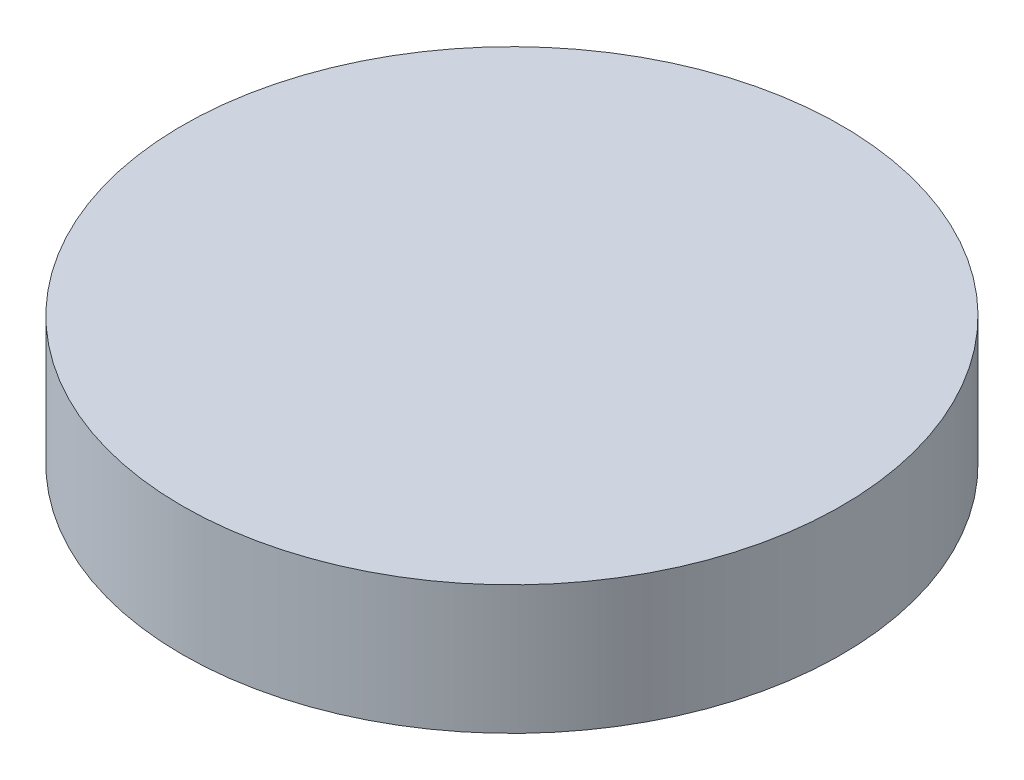
ISO-10303-21;
HEADER;
FILE_DESCRIPTION(('STEP AP214'),'2;1');
FILE_NAME('part.step','',(''),(''),'','','');
FILE_SCHEMA(('AUTOMOTIVE_DESIGN { 1 0 10303 214 1 1 1 1 }'));
ENDSEC;
DATA;
#1=APPLICATION_CONTEXT('core data for automotive mechanical design processes');
#2=APPLICATION_PROTOCOL_DEFINITION('international standard','automotive_design',2000,#1);
#3=PRODUCT_CONTEXT('',#1,'mechanical');
#4=PRODUCT('Part','Part','',(#3));
#5=PRODUCT_RELATED_PRODUCT_CATEGORY('part','',(#4));
#6=PRODUCT_DEFINITION_FORMATION('','',#4);
#7=PRODUCT_DEFINITION_CONTEXT('part definition',#1,'design');
#8=PRODUCT_DEFINITION('design','',#6,#7);
#9=PRODUCT_DEFINITION_SHAPE('','',#8);
#10=(LENGTH_UNIT() NAMED_UNIT(*) SI_UNIT(.MILLI.,.METRE.));
#11=(NAMED_UNIT(*) PLANE_ANGLE_UNIT() SI_UNIT($,.RADIAN.));
#12=(NAMED_UNIT(*) SI_UNIT($,.STERADIAN.) SOLID_ANGLE_UNIT());
#13=UNCERTAINTY_MEASURE_WITH_UNIT(LENGTH_MEASURE(1.E-05),#10,'distance_accuracy_value','');
#14=(GEOMETRIC_REPRESENTATION_CONTEXT(3) GLOBAL_UNCERTAINTY_ASSIGNED_CONTEXT((#13)) GLOBAL_UNIT_ASSIGNED_CONTEXT((#10,
#11,#12)) REPRESENTATION_CONTEXT('',''));
#15=CARTESIAN_POINT('',(0.,0.,0.));
#16=DIRECTION('',(0.,0.,1.));
#17=DIRECTION('',(1.,0.,0.));
#18=AXIS2_PLACEMENT_3D('',#15,#16,#17);
#19=CARTESIAN_POINT('',(0.,2.44,0.));
#20=DIRECTION('',(0.,-1.,0.));
#21=DIRECTION('',(0.,0.,-1.));
#22=AXIS2_PLACEMENT_3D('',#19,#20,#21);
#23=CYLINDRICAL_SURFACE('',#22,6.25);
#24=CARTESIAN_POINT('',(0.,2.44,0.));
#25=DIRECTION('',(0.,1.,0.));
#26=DIRECTION('',(0.,0.,1.));
#27=AXIS2_PLACEMENT_3D('',#24,#25,#26);
#28=CIRCLE('',#27,6.25);
#29=CARTESIAN_POINT('',(0.,2.44,6.25));
#30=VERTEX_POINT('',#29);
#31=EDGE_CURVE('E10',#30,#30,#28,.T.);
#32=ORIENTED_EDGE('',*,*,#31,.F.);
#33=EDGE_LOOP('',(#32));
#34=FACE_BOUND('',#33,.T.);
#35=CARTESIAN_POINT('',(0.,0.,0.));
#36=DIRECTION('',(0.,1.,0.));
#37=DIRECTION('',(0.,0.,1.));
#38=AXIS2_PLACEMENT_3D('',#35,#36,#37);
#39=CIRCLE('',#38,6.25);
#40=CARTESIAN_POINT('',(0.,0.,6.25));
#41=VERTEX_POINT('',#40);
#42=EDGE_CURVE('E36',#41,#41,#39,.T.);
#43=ORIENTED_EDGE('',*,*,#42,.T.);
#44=EDGE_LOOP('',(#43));
#45=FACE_BOUND('',#44,.T.);
#46=ADVANCED_FACE('F33',(#34,#45),#23,.T.);
#47=CARTESIAN_POINT('',(0.,2.44,0.));
#48=DIRECTION('',(0.,1.,0.));
#49=DIRECTION('',(0.,0.,1.));
#50=AXIS2_PLACEMENT_3D('',#47,#48,#49);
#51=PLANE('',#50);
#52=ORIENTED_EDGE('',*,*,#31,.T.);
#53=EDGE_LOOP('',(#52));
#54=FACE_BOUND('',#53,.T.);
#55=ADVANCED_FACE('F48',(#54),#51,.T.);
#56=CARTESIAN_POINT('',(0.,0.,0.));
#57=DIRECTION('',(0.,1.,0.));
#58=DIRECTION('',(0.,0.,1.));
#59=AXIS2_PLACEMENT_3D('',#56,#57,#58);
#60=PLANE('',#59);
#61=ORIENTED_EDGE('',*,*,#42,.F.);
#62=EDGE_LOOP('',(#61));
#63=FACE_BOUND('',#62,.T.);
#64=ADVANCED_FACE('F46',(#63),#60,.F.);
#65=CLOSED_SHELL('',(#46,#55,#64));
#66=MANIFOLD_SOLID_BREP('B2',#65);
#67=ADVANCED_BREP_SHAPE_REPRESENTATION('',(#18,#66),#14);
#68=SHAPE_DEFINITION_REPRESENTATION(#9,#67);
ENDSEC;
END-ISO-10303-21;
